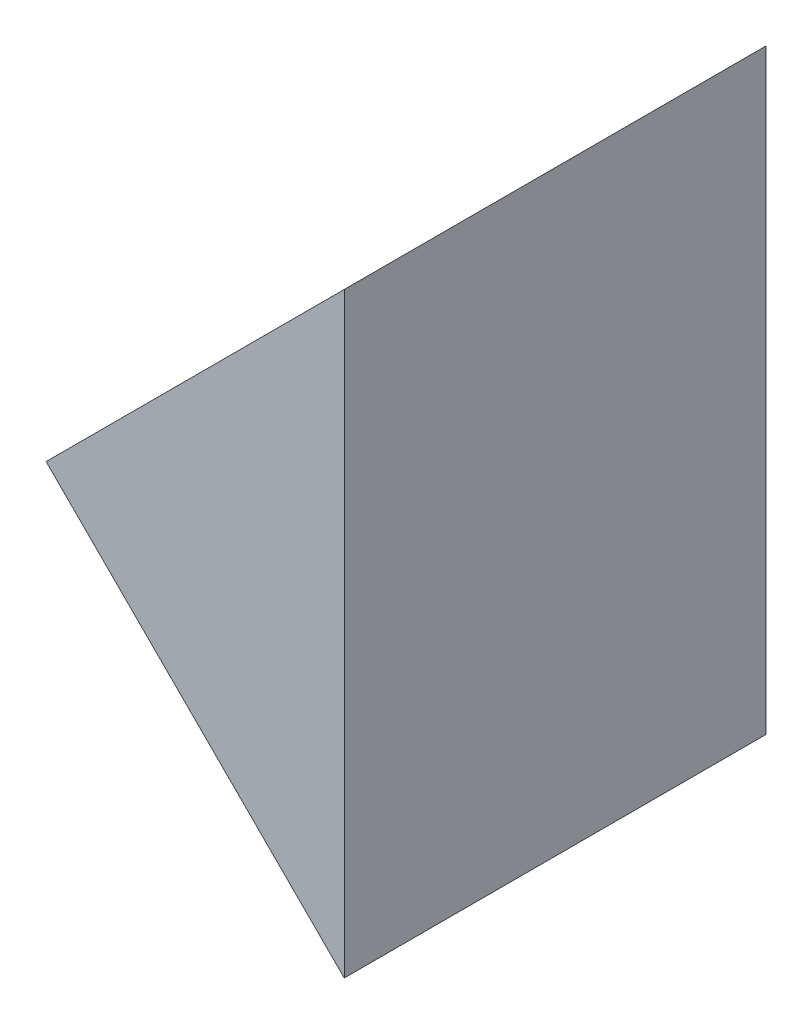
ISO-10303-21;
HEADER;
FILE_DESCRIPTION(('STEP AP214'),'2;1');
FILE_NAME('part.step','',(''),(''),'','','');
FILE_SCHEMA(('AUTOMOTIVE_DESIGN { 1 0 10303 214 1 1 1 1 }'));
ENDSEC;
DATA;
#1=APPLICATION_CONTEXT('core data for automotive mechanical design processes');
#2=APPLICATION_PROTOCOL_DEFINITION('international standard','automotive_design',2000,#1);
#3=PRODUCT_CONTEXT('',#1,'mechanical');
#4=PRODUCT('Part','Part','',(#3));
#5=PRODUCT_RELATED_PRODUCT_CATEGORY('part','',(#4));
#6=PRODUCT_DEFINITION_FORMATION('','',#4);
#7=PRODUCT_DEFINITION_CONTEXT('part definition',#1,'design');
#8=PRODUCT_DEFINITION('design','',#6,#7);
#9=PRODUCT_DEFINITION_SHAPE('','',#8);
#10=(LENGTH_UNIT() NAMED_UNIT(*) SI_UNIT(.MILLI.,.METRE.));
#11=(NAMED_UNIT(*) PLANE_ANGLE_UNIT() SI_UNIT($,.RADIAN.));
#12=(NAMED_UNIT(*) SI_UNIT($,.STERADIAN.) SOLID_ANGLE_UNIT());
#13=UNCERTAINTY_MEASURE_WITH_UNIT(LENGTH_MEASURE(1.E-05),#10,'distance_accuracy_value','');
#14=(GEOMETRIC_REPRESENTATION_CONTEXT(3) GLOBAL_UNCERTAINTY_ASSIGNED_CONTEXT((#13)) GLOBAL_UNIT_ASSIGNED_CONTEXT((#10,
#11,#12)) REPRESENTATION_CONTEXT('',''));
#15=CARTESIAN_POINT('',(0.,0.,0.));
#16=DIRECTION('',(0.,0.,1.));
#17=DIRECTION('',(1.,0.,0.));
#18=AXIS2_PLACEMENT_3D('',#15,#16,#17);
#19=CARTESIAN_POINT('',(563.007194827291,144.27051646975,40.));
#20=DIRECTION('',(0.707106781186548,0.707106781186548,0.));
#21=DIRECTION('',(-0.707106781186548,0.707106781186548,0.));
#22=AXIS2_PLACEMENT_3D('',#19,#20,#21);
#23=PLANE('',#22);
#24=DIRECTION('',(0.707106781186547,-0.707106781186547,0.));
#25=VECTOR('',#24,1.);
#26=CARTESIAN_POINT('',(563.007194827291,144.27051646975,0.));
#27=LINE('',#26,#25);
#28=CARTESIAN_POINT('',(563.007194827291,144.27051646975,0.));
#29=VERTEX_POINT('',#28);
#30=CARTESIAN_POINT('',(591.291466074753,115.986245222288,0.));
#31=VERTEX_POINT('',#30);
#32=EDGE_CURVE('E84',#29,#31,#27,.T.);
#33=ORIENTED_EDGE('',*,*,#32,.T.);
#34=DIRECTION('',(0.,0.,-1.));
#35=VECTOR('',#34,1.);
#36=CARTESIAN_POINT('',(591.291466074753,115.986245222288,40.));
#37=LINE('',#36,#35);
#38=CARTESIAN_POINT('',(591.291466074753,115.986245222288,40.));
#39=VERTEX_POINT('',#38);
#40=EDGE_CURVE('E11',#39,#31,#37,.T.);
#41=ORIENTED_EDGE('',*,*,#40,.F.);
#42=DIRECTION('',(0.707106781186547,-0.707106781186547,0.));
#43=VECTOR('',#42,1.);
#44=CARTESIAN_POINT('',(563.007194827291,144.27051646975,40.));
#45=LINE('',#44,#43);
#46=CARTESIAN_POINT('',(563.007194827291,144.27051646975,40.));
#47=VERTEX_POINT('',#46);
#48=EDGE_CURVE('E77',#47,#39,#45,.T.);
#49=ORIENTED_EDGE('',*,*,#48,.F.);
#50=DIRECTION('',(0.,0.,-1.));
#51=VECTOR('',#50,1.);
#52=CARTESIAN_POINT('',(563.007194827291,144.27051646975,40.));
#53=LINE('',#52,#51);
#54=EDGE_CURVE('E85',#47,#29,#53,.T.);
#55=ORIENTED_EDGE('',*,*,#54,.T.);
#56=EDGE_LOOP('',(#33,#41,#49,#55));
#57=FACE_BOUND('',#56,.T.);
#58=ADVANCED_FACE('F37',(#57),#23,.F.);
#59=CARTESIAN_POINT('',(591.291466074753,115.986245222288,40.));
#60=DIRECTION('',(-1.,0.,0.));
#61=DIRECTION('',(0.,0.,1.));
#62=AXIS2_PLACEMENT_3D('',#59,#60,#61);
#63=PLANE('',#62);
#64=DIRECTION('',(0.,1.,0.));
#65=VECTOR('',#64,1.);
#66=CARTESIAN_POINT('',(591.291466074753,115.986245222288,0.));
#67=LINE('',#66,#65);
#68=CARTESIAN_POINT('',(591.291466074753,172.554787717212,0.));
#69=VERTEX_POINT('',#68);
#70=EDGE_CURVE('E65',#31,#69,#67,.T.);
#71=ORIENTED_EDGE('',*,*,#70,.T.);
#72=DIRECTION('',(0.,0.,-1.));
#73=VECTOR('',#72,1.);
#74=CARTESIAN_POINT('',(591.291466074753,172.554787717212,40.));
#75=LINE('',#74,#73);
#76=CARTESIAN_POINT('',(591.291466074753,172.554787717212,40.));
#77=VERTEX_POINT('',#76);
#78=EDGE_CURVE('E45',#77,#69,#75,.T.);
#79=ORIENTED_EDGE('',*,*,#78,.F.);
#80=DIRECTION('',(0.,1.,0.));
#81=VECTOR('',#80,1.);
#82=CARTESIAN_POINT('',(591.291466074753,115.986245222288,40.));
#83=LINE('',#82,#81);
#84=EDGE_CURVE('E73',#39,#77,#83,.T.);
#85=ORIENTED_EDGE('',*,*,#84,.F.);
#86=ORIENTED_EDGE('',*,*,#40,.T.);
#87=EDGE_LOOP('',(#71,#79,#85,#86));
#88=FACE_BOUND('',#87,.T.);
#89=ADVANCED_FACE('F74',(#88),#63,.F.);
#90=CARTESIAN_POINT('',(563.007194827291,144.27051646975,40.));
#91=DIRECTION('',(0.707106781186547,-0.707106781186548,0.));
#92=DIRECTION('',(0.707106781186548,0.707106781186547,0.));
#93=AXIS2_PLACEMENT_3D('',#90,#91,#92);
#94=PLANE('',#93);
#95=DIRECTION('',(-0.707106781186548,-0.707106781186547,0.));
#96=VECTOR('',#95,1.);
#97=CARTESIAN_POINT('',(563.007194827291,144.27051646975,0.));
#98=LINE('',#97,#96);
#99=EDGE_CURVE('E70',#69,#29,#98,.T.);
#100=ORIENTED_EDGE('',*,*,#99,.T.);
#101=ORIENTED_EDGE('',*,*,#54,.F.);
#102=DIRECTION('',(-0.707106781186548,-0.707106781186547,0.));
#103=VECTOR('',#102,1.);
#104=CARTESIAN_POINT('',(563.007194827291,144.27051646975,40.));
#105=LINE('',#104,#103);
#106=EDGE_CURVE('E53',#77,#47,#105,.T.);
#107=ORIENTED_EDGE('',*,*,#106,.F.);
#108=ORIENTED_EDGE('',*,*,#78,.T.);
#109=EDGE_LOOP('',(#100,#101,#107,#108));
#110=FACE_BOUND('',#109,.T.);
#111=ADVANCED_FACE('F92',(#110),#94,.F.);
#112=CARTESIAN_POINT('',(0.,0.,40.));
#113=DIRECTION('',(0.,0.,1.));
#114=DIRECTION('',(1.,0.,0.));
#115=AXIS2_PLACEMENT_3D('',#112,#113,#114);
#116=PLANE('',#115);
#117=ORIENTED_EDGE('',*,*,#48,.T.);
#118=ORIENTED_EDGE('',*,*,#84,.T.);
#119=ORIENTED_EDGE('',*,*,#106,.T.);
#120=EDGE_LOOP('',(#117,#118,#119));
#121=FACE_BOUND('',#120,.T.);
#122=ADVANCED_FACE('F80',(#121),#116,.T.);
#123=CARTESIAN_POINT('',(0.,0.,0.));
#124=DIRECTION('',(0.,0.,1.));
#125=DIRECTION('',(1.,0.,0.));
#126=AXIS2_PLACEMENT_3D('',#123,#124,#125);
#127=PLANE('',#126);
#128=ORIENTED_EDGE('',*,*,#32,.F.);
#129=ORIENTED_EDGE('',*,*,#99,.F.);
#130=ORIENTED_EDGE('',*,*,#70,.F.);
#131=EDGE_LOOP('',(#128,#129,#130));
#132=FACE_BOUND('',#131,.T.);
#133=ADVANCED_FACE('F93',(#132),#127,.F.);
#134=CLOSED_SHELL('',(#58,#89,#111,#122,#133));
#135=MANIFOLD_SOLID_BREP('B2',#134);
#136=ADVANCED_BREP_SHAPE_REPRESENTATION('',(#18,#135),#14);
#137=SHAPE_DEFINITION_REPRESENTATION(#9,#136);
ENDSEC;
END-ISO-10303-21;
